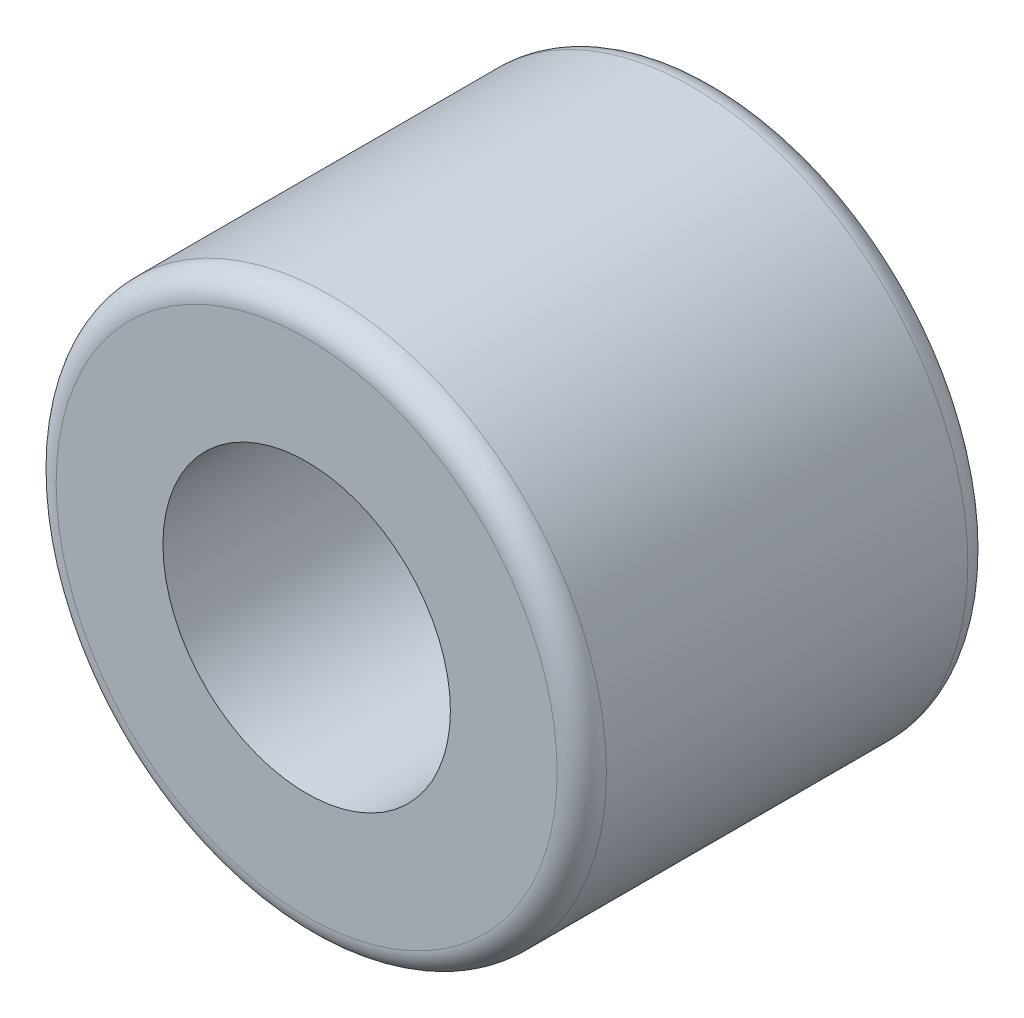
ISO-10303-21;
HEADER;
FILE_DESCRIPTION(('STEP AP214'),'2;1');
FILE_NAME('part.step','',(''),(''),'','','');
FILE_SCHEMA(('AUTOMOTIVE_DESIGN { 1 0 10303 214 1 1 1 1 }'));
ENDSEC;
DATA;
#1=APPLICATION_CONTEXT('core data for automotive mechanical design processes');
#2=APPLICATION_PROTOCOL_DEFINITION('international standard','automotive_design',2000,#1);
#3=PRODUCT_CONTEXT('',#1,'mechanical');
#4=PRODUCT('Part','Part','',(#3));
#5=PRODUCT_RELATED_PRODUCT_CATEGORY('part','',(#4));
#6=PRODUCT_DEFINITION_FORMATION('','',#4);
#7=PRODUCT_DEFINITION_CONTEXT('part definition',#1,'design');
#8=PRODUCT_DEFINITION('design','',#6,#7);
#9=PRODUCT_DEFINITION_SHAPE('','',#8);
#10=(LENGTH_UNIT() NAMED_UNIT(*) SI_UNIT(.MILLI.,.METRE.));
#11=(NAMED_UNIT(*) PLANE_ANGLE_UNIT() SI_UNIT($,.RADIAN.));
#12=(NAMED_UNIT(*) SI_UNIT($,.STERADIAN.) SOLID_ANGLE_UNIT());
#13=UNCERTAINTY_MEASURE_WITH_UNIT(LENGTH_MEASURE(1.E-05),#10,'distance_accuracy_value','');
#14=(GEOMETRIC_REPRESENTATION_CONTEXT(3) GLOBAL_UNCERTAINTY_ASSIGNED_CONTEXT((#13)) GLOBAL_UNIT_ASSIGNED_CONTEXT((#10,
#11,#12)) REPRESENTATION_CONTEXT('',''));
#15=CARTESIAN_POINT('',(0.,0.,0.));
#16=DIRECTION('',(0.,0.,1.));
#17=DIRECTION('',(1.,0.,0.));
#18=AXIS2_PLACEMENT_3D('',#15,#16,#17);
#19=CARTESIAN_POINT('',(0.,0.,12.7));
#20=DIRECTION('',(0.,0.,1.));
#21=DIRECTION('',(1.,0.,0.));
#22=AXIS2_PLACEMENT_3D('',#19,#20,#21);
#23=PLANE('',#22);
#24=CARTESIAN_POINT('',(0.,0.,12.7));
#25=DIRECTION('',(0.,0.,1.));
#26=DIRECTION('',(1.,0.,0.));
#27=AXIS2_PLACEMENT_3D('',#24,#25,#26);
#28=CIRCLE('',#27,7.747);
#29=CARTESIAN_POINT('',(7.747,0.,12.7));
#30=VERTEX_POINT('',#29);
#31=EDGE_CURVE('E10',#30,#30,#28,.T.);
#32=ORIENTED_EDGE('',*,*,#31,.T.);
#33=EDGE_LOOP('',(#32));
#34=FACE_BOUND('',#33,.T.);
#35=CARTESIAN_POINT('',(0.,0.,12.7));
#36=DIRECTION('',(0.,0.,1.));
#37=DIRECTION('',(1.,0.,0.));
#38=AXIS2_PLACEMENT_3D('',#35,#36,#37);
#39=CIRCLE('',#38,4.445);
#40=CARTESIAN_POINT('',(4.445,0.,12.7));
#41=VERTEX_POINT('',#40);
#42=EDGE_CURVE('E66',#41,#41,#39,.T.);
#43=ORIENTED_EDGE('',*,*,#42,.F.);
#44=EDGE_LOOP('',(#43));
#45=FACE_BOUND('',#44,.T.);
#46=ADVANCED_FACE('F39',(#34,#45),#23,.T.);
#47=CARTESIAN_POINT('',(0.,0.,0.));
#48=DIRECTION('',(0.,0.,1.));
#49=DIRECTION('',(1.,0.,0.));
#50=AXIS2_PLACEMENT_3D('',#47,#48,#49);
#51=PLANE('',#50);
#52=CARTESIAN_POINT('',(0.,0.,0.));
#53=DIRECTION('',(0.,0.,1.));
#54=DIRECTION('',(1.,0.,0.));
#55=AXIS2_PLACEMENT_3D('',#52,#53,#54);
#56=CIRCLE('',#55,7.747);
#57=CARTESIAN_POINT('',(7.747,0.,0.));
#58=VERTEX_POINT('',#57);
#59=EDGE_CURVE('E47',#58,#58,#56,.F.);
#60=ORIENTED_EDGE('',*,*,#59,.T.);
#61=EDGE_LOOP('',(#60));
#62=FACE_BOUND('',#61,.T.);
#63=CARTESIAN_POINT('',(0.,0.,0.));
#64=DIRECTION('',(0.,0.,1.));
#65=DIRECTION('',(1.,0.,0.));
#66=AXIS2_PLACEMENT_3D('',#63,#64,#65);
#67=CIRCLE('',#66,4.445);
#68=CARTESIAN_POINT('',(4.445,0.,0.));
#69=VERTEX_POINT('',#68);
#70=EDGE_CURVE('E67',#69,#69,#67,.T.);
#71=ORIENTED_EDGE('',*,*,#70,.T.);
#72=EDGE_LOOP('',(#71));
#73=FACE_BOUND('',#72,.T.);
#74=ADVANCED_FACE('F80',(#62,#73),#51,.F.);
#75=CARTESIAN_POINT('',(0.,0.,12.7));
#76=DIRECTION('',(0.,0.,-1.));
#77=DIRECTION('',(-1.,0.,0.));
#78=AXIS2_PLACEMENT_3D('',#75,#76,#77);
#79=CYLINDRICAL_SURFACE('',#78,8.509);
#80=CARTESIAN_POINT('',(0.,0.,0.762000000000001));
#81=DIRECTION('',(0.,0.,1.));
#82=DIRECTION('',(1.,0.,0.));
#83=AXIS2_PLACEMENT_3D('',#80,#81,#82);
#84=CIRCLE('',#83,8.509);
#85=CARTESIAN_POINT('',(8.509,0.,0.762000000000001));
#86=VERTEX_POINT('',#85);
#87=EDGE_CURVE('E54',#86,#86,#84,.T.);
#88=ORIENTED_EDGE('',*,*,#87,.T.);
#89=EDGE_LOOP('',(#88));
#90=FACE_BOUND('',#89,.T.);
#91=CARTESIAN_POINT('',(0.,0.,11.938));
#92=DIRECTION('',(0.,0.,1.));
#93=DIRECTION('',(1.,0.,0.));
#94=AXIS2_PLACEMENT_3D('',#91,#92,#93);
#95=CIRCLE('',#94,8.509);
#96=CARTESIAN_POINT('',(8.509,0.,11.938));
#97=VERTEX_POINT('',#96);
#98=EDGE_CURVE('E60',#97,#97,#95,.F.);
#99=ORIENTED_EDGE('',*,*,#98,.T.);
#100=EDGE_LOOP('',(#99));
#101=FACE_BOUND('',#100,.T.);
#102=ADVANCED_FACE('F85',(#90,#101),#79,.T.);
#103=CARTESIAN_POINT('',(0.,0.,12.7));
#104=DIRECTION('',(0.,0.,-1.));
#105=DIRECTION('',(-1.,0.,0.));
#106=AXIS2_PLACEMENT_3D('',#103,#104,#105);
#107=CYLINDRICAL_SURFACE('',#106,4.445);
#108=ORIENTED_EDGE('',*,*,#42,.T.);
#109=EDGE_LOOP('',(#108));
#110=FACE_BOUND('',#109,.T.);
#111=ORIENTED_EDGE('',*,*,#70,.F.);
#112=EDGE_LOOP('',(#111));
#113=FACE_BOUND('',#112,.T.);
#114=ADVANCED_FACE('F76',(#110,#113),#107,.F.);
#115=CARTESIAN_POINT('',(0.,0.,0.762000000000001));
#116=DIRECTION('',(0.,0.,1.));
#117=DIRECTION('',(1.,0.,0.));
#118=AXIS2_PLACEMENT_3D('',#115,#116,#117);
#119=TOROIDAL_SURFACE('',#118,7.747,0.762);
#120=ORIENTED_EDGE('',*,*,#59,.F.);
#121=EDGE_LOOP('',(#120));
#122=FACE_BOUND('',#121,.T.);
#123=ORIENTED_EDGE('',*,*,#87,.F.);
#124=EDGE_LOOP('',(#123));
#125=FACE_BOUND('',#124,.T.);
#126=ADVANCED_FACE('F91',(#122,#125),#119,.T.);
#127=CARTESIAN_POINT('',(0.,0.,11.938));
#128=DIRECTION('',(0.,0.,1.));
#129=DIRECTION('',(1.,0.,0.));
#130=AXIS2_PLACEMENT_3D('',#127,#128,#129);
#131=TOROIDAL_SURFACE('',#130,7.747,0.762);
#132=ORIENTED_EDGE('',*,*,#98,.F.);
#133=EDGE_LOOP('',(#132));
#134=FACE_BOUND('',#133,.T.);
#135=ORIENTED_EDGE('',*,*,#31,.F.);
#136=EDGE_LOOP('',(#135));
#137=FACE_BOUND('',#136,.T.);
#138=ADVANCED_FACE('F41',(#134,#137),#131,.T.);
#139=CLOSED_SHELL('',(#46,#74,#102,#114,#126,#138));
#140=MANIFOLD_SOLID_BREP('B2',#139);
#141=ADVANCED_BREP_SHAPE_REPRESENTATION('',(#18,#140),#14);
#142=SHAPE_DEFINITION_REPRESENTATION(#9,#141);
ENDSEC;
END-ISO-10303-21;
